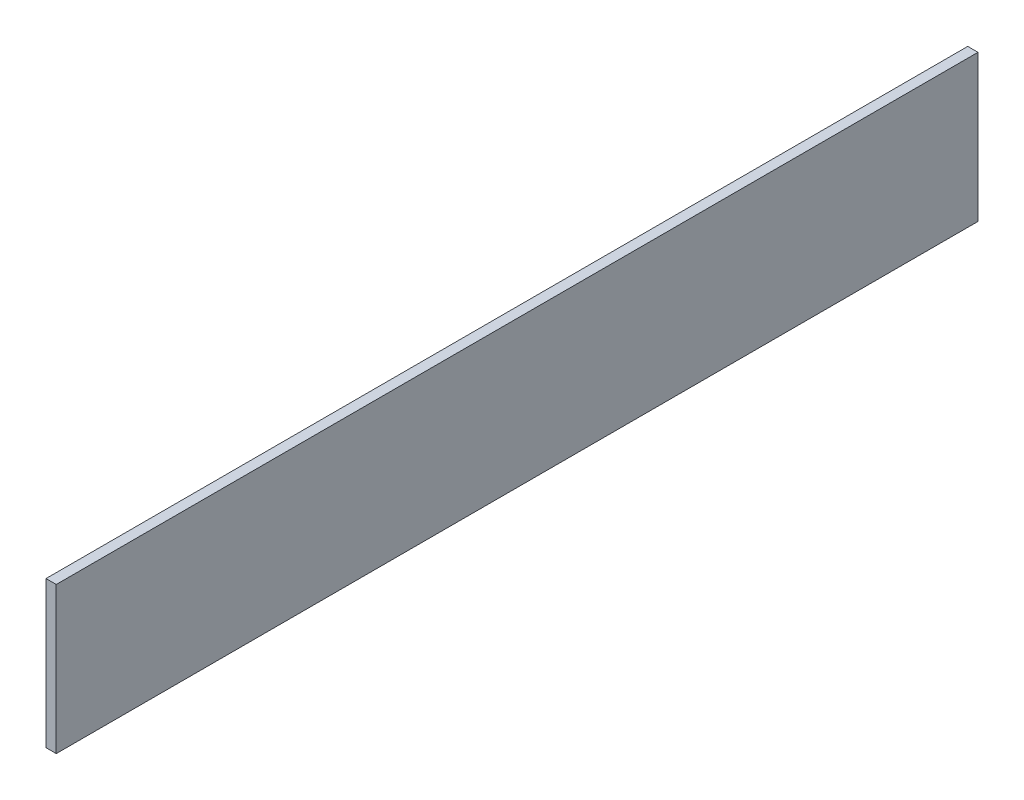
ISO-10303-21;
HEADER;
FILE_DESCRIPTION(('STEP AP214'),'2;1');
FILE_NAME('part.step','',(''),(''),'','','');
FILE_SCHEMA(('AUTOMOTIVE_DESIGN { 1 0 10303 214 1 1 1 1 }'));
ENDSEC;
DATA;
#1=APPLICATION_CONTEXT('core data for automotive mechanical design processes');
#2=APPLICATION_PROTOCOL_DEFINITION('international standard','automotive_design',2000,#1);
#3=PRODUCT_CONTEXT('',#1,'mechanical');
#4=PRODUCT('Part','Part','',(#3));
#5=PRODUCT_RELATED_PRODUCT_CATEGORY('part','',(#4));
#6=PRODUCT_DEFINITION_FORMATION('','',#4);
#7=PRODUCT_DEFINITION_CONTEXT('part definition',#1,'design');
#8=PRODUCT_DEFINITION('design','',#6,#7);
#9=PRODUCT_DEFINITION_SHAPE('','',#8);
#10=(LENGTH_UNIT() NAMED_UNIT(*) SI_UNIT(.MILLI.,.METRE.));
#11=(NAMED_UNIT(*) PLANE_ANGLE_UNIT() SI_UNIT($,.RADIAN.));
#12=(NAMED_UNIT(*) SI_UNIT($,.STERADIAN.) SOLID_ANGLE_UNIT());
#13=UNCERTAINTY_MEASURE_WITH_UNIT(LENGTH_MEASURE(1.E-05),#10,'distance_accuracy_value','');
#14=(GEOMETRIC_REPRESENTATION_CONTEXT(3) GLOBAL_UNCERTAINTY_ASSIGNED_CONTEXT((#13)) GLOBAL_UNIT_ASSIGNED_CONTEXT((#10,
#11,#12)) REPRESENTATION_CONTEXT('',''));
#15=CARTESIAN_POINT('',(0.,0.,0.));
#16=DIRECTION('',(0.,0.,1.));
#17=DIRECTION('',(1.,0.,0.));
#18=AXIS2_PLACEMENT_3D('',#15,#16,#17);
#19=CARTESIAN_POINT('',(97.5,182.5,450.));
#20=DIRECTION('',(-1.,0.,0.));
#21=DIRECTION('',(0.,0.,1.));
#22=AXIS2_PLACEMENT_3D('',#19,#20,#21);
#23=PLANE('',#22);
#24=DIRECTION('',(0.,1.,0.));
#25=VECTOR('',#24,1.);
#26=CARTESIAN_POINT('',(97.5,182.5,0.));
#27=LINE('',#26,#25);
#28=CARTESIAN_POINT('',(97.5,182.5,0.));
#29=VERTEX_POINT('',#28);
#30=CARTESIAN_POINT('',(97.5,254.023673560284,0.));
#31=VERTEX_POINT('',#30);
#32=EDGE_CURVE('E96',#29,#31,#27,.T.);
#33=ORIENTED_EDGE('',*,*,#32,.T.);
#34=DIRECTION('',(0.,0.,-1.));
#35=VECTOR('',#34,1.);
#36=CARTESIAN_POINT('',(97.5,254.023673560284,450.));
#37=LINE('',#36,#35);
#38=CARTESIAN_POINT('',(97.5,254.023673560284,450.));
#39=VERTEX_POINT('',#38);
#40=EDGE_CURVE('E11',#39,#31,#37,.T.);
#41=ORIENTED_EDGE('',*,*,#40,.F.);
#42=DIRECTION('',(0.,1.,0.));
#43=VECTOR('',#42,1.);
#44=CARTESIAN_POINT('',(97.5,182.5,450.));
#45=LINE('',#44,#43);
#46=CARTESIAN_POINT('',(97.5,182.5,450.));
#47=VERTEX_POINT('',#46);
#48=EDGE_CURVE('E84',#47,#39,#45,.T.);
#49=ORIENTED_EDGE('',*,*,#48,.F.);
#50=DIRECTION('',(0.,0.,-1.));
#51=VECTOR('',#50,1.);
#52=CARTESIAN_POINT('',(97.5,182.5,450.));
#53=LINE('',#52,#51);
#54=EDGE_CURVE('E92',#47,#29,#53,.T.);
#55=ORIENTED_EDGE('',*,*,#54,.T.);
#56=EDGE_LOOP('',(#33,#41,#49,#55));
#57=FACE_BOUND('',#56,.T.);
#58=ADVANCED_FACE('F33',(#57),#23,.F.);
#59=CARTESIAN_POINT('',(97.5,254.023673560284,450.));
#60=DIRECTION('',(0.,-1.,0.));
#61=DIRECTION('',(0.,0.,-1.));
#62=AXIS2_PLACEMENT_3D('',#59,#60,#61);
#63=PLANE('',#62);
#64=DIRECTION('',(-1.,0.,0.));
#65=VECTOR('',#64,1.);
#66=CARTESIAN_POINT('',(97.5,254.023673560284,0.));
#67=LINE('',#66,#65);
#68=CARTESIAN_POINT('',(92.5,254.023673560284,0.));
#69=VERTEX_POINT('',#68);
#70=EDGE_CURVE('E88',#31,#69,#67,.T.);
#71=ORIENTED_EDGE('',*,*,#70,.T.);
#72=DIRECTION('',(0.,0.,-1.));
#73=VECTOR('',#72,1.);
#74=CARTESIAN_POINT('',(92.5,254.023673560284,450.));
#75=LINE('',#74,#73);
#76=CARTESIAN_POINT('',(92.5,254.023673560284,450.));
#77=VERTEX_POINT('',#76);
#78=EDGE_CURVE('E41',#77,#69,#75,.T.);
#79=ORIENTED_EDGE('',*,*,#78,.F.);
#80=DIRECTION('',(-1.,0.,0.));
#81=VECTOR('',#80,1.);
#82=CARTESIAN_POINT('',(97.5,254.023673560284,450.));
#83=LINE('',#82,#81);
#84=EDGE_CURVE('E79',#39,#77,#83,.T.);
#85=ORIENTED_EDGE('',*,*,#84,.F.);
#86=ORIENTED_EDGE('',*,*,#40,.T.);
#87=EDGE_LOOP('',(#71,#79,#85,#86));
#88=FACE_BOUND('',#87,.T.);
#89=ADVANCED_FACE('F87',(#88),#63,.F.);
#90=CARTESIAN_POINT('',(92.5,254.023673560284,450.));
#91=DIRECTION('',(1.,0.,0.));
#92=DIRECTION('',(0.,1.,0.));
#93=AXIS2_PLACEMENT_3D('',#90,#91,#92);
#94=PLANE('',#93);
#95=DIRECTION('',(0.,-1.,0.));
#96=VECTOR('',#95,1.);
#97=CARTESIAN_POINT('',(92.5,254.023673560284,0.));
#98=LINE('',#97,#96);
#99=CARTESIAN_POINT('',(92.5,182.5,0.));
#100=VERTEX_POINT('',#99);
#101=EDGE_CURVE('E66',#69,#100,#98,.T.);
#102=ORIENTED_EDGE('',*,*,#101,.T.);
#103=DIRECTION('',(0.,0.,-1.));
#104=VECTOR('',#103,1.);
#105=CARTESIAN_POINT('',(92.5,182.5,450.));
#106=LINE('',#105,#104);
#107=CARTESIAN_POINT('',(92.5,182.5,450.));
#108=VERTEX_POINT('',#107);
#109=EDGE_CURVE('E89',#108,#100,#106,.T.);
#110=ORIENTED_EDGE('',*,*,#109,.F.);
#111=DIRECTION('',(0.,-1.,0.));
#112=VECTOR('',#111,1.);
#113=CARTESIAN_POINT('',(92.5,254.023673560284,450.));
#114=LINE('',#113,#112);
#115=EDGE_CURVE('E82',#77,#108,#114,.T.);
#116=ORIENTED_EDGE('',*,*,#115,.F.);
#117=ORIENTED_EDGE('',*,*,#78,.T.);
#118=EDGE_LOOP('',(#102,#110,#116,#117));
#119=FACE_BOUND('',#118,.T.);
#120=ADVANCED_FACE('F90',(#119),#94,.F.);
#121=CARTESIAN_POINT('',(97.5,182.5,450.));
#122=DIRECTION('',(0.,1.,0.));
#123=DIRECTION('',(0.,0.,1.));
#124=AXIS2_PLACEMENT_3D('',#121,#122,#123);
#125=PLANE('',#124);
#126=DIRECTION('',(1.,0.,0.));
#127=VECTOR('',#126,1.);
#128=CARTESIAN_POINT('',(97.5,182.5,0.));
#129=LINE('',#128,#127);
#130=EDGE_CURVE('E72',#100,#29,#129,.T.);
#131=ORIENTED_EDGE('',*,*,#130,.T.);
#132=ORIENTED_EDGE('',*,*,#54,.F.);
#133=DIRECTION('',(1.,0.,0.));
#134=VECTOR('',#133,1.);
#135=CARTESIAN_POINT('',(97.5,182.5,450.));
#136=LINE('',#135,#134);
#137=EDGE_CURVE('E49',#108,#47,#136,.T.);
#138=ORIENTED_EDGE('',*,*,#137,.F.);
#139=ORIENTED_EDGE('',*,*,#109,.T.);
#140=EDGE_LOOP('',(#131,#132,#138,#139));
#141=FACE_BOUND('',#140,.T.);
#142=ADVANCED_FACE('F103',(#141),#125,.F.);
#143=CARTESIAN_POINT('',(0.,0.,450.));
#144=DIRECTION('',(0.,0.,1.));
#145=DIRECTION('',(1.,0.,0.));
#146=AXIS2_PLACEMENT_3D('',#143,#144,#145);
#147=PLANE('',#146);
#148=ORIENTED_EDGE('',*,*,#48,.T.);
#149=ORIENTED_EDGE('',*,*,#84,.T.);
#150=ORIENTED_EDGE('',*,*,#115,.T.);
#151=ORIENTED_EDGE('',*,*,#137,.T.);
#152=EDGE_LOOP('',(#148,#149,#150,#151));
#153=FACE_BOUND('',#152,.T.);
#154=ADVANCED_FACE('F80',(#153),#147,.T.);
#155=CARTESIAN_POINT('',(0.,0.,0.));
#156=DIRECTION('',(0.,0.,1.));
#157=DIRECTION('',(1.,0.,0.));
#158=AXIS2_PLACEMENT_3D('',#155,#156,#157);
#159=PLANE('',#158);
#160=ORIENTED_EDGE('',*,*,#32,.F.);
#161=ORIENTED_EDGE('',*,*,#130,.F.);
#162=ORIENTED_EDGE('',*,*,#101,.F.);
#163=ORIENTED_EDGE('',*,*,#70,.F.);
#164=EDGE_LOOP('',(#160,#161,#162,#163));
#165=FACE_BOUND('',#164,.T.);
#166=ADVANCED_FACE('F106',(#165),#159,.F.);
#167=CLOSED_SHELL('',(#58,#89,#120,#142,#154,#166));
#168=MANIFOLD_SOLID_BREP('B2',#167);
#169=ADVANCED_BREP_SHAPE_REPRESENTATION('',(#18,#168),#14);
#170=SHAPE_DEFINITION_REPRESENTATION(#9,#169);
ENDSEC;
END-ISO-10303-21;
